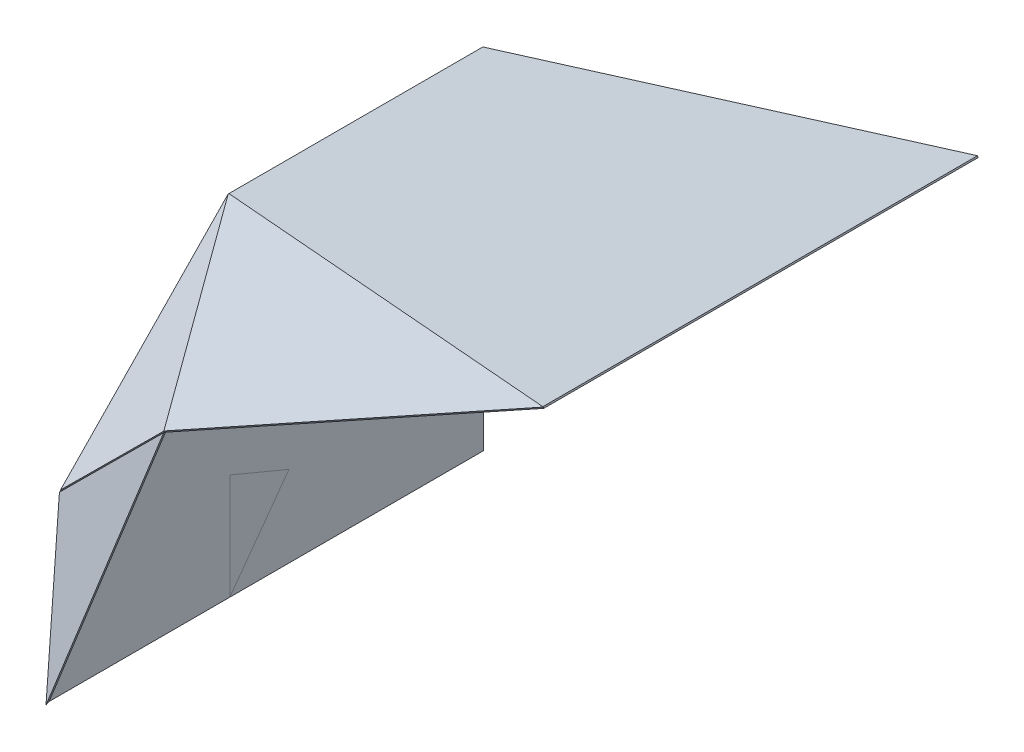
ISO-10303-21;
HEADER;
FILE_DESCRIPTION(('STEP AP214'),'2;1');
FILE_NAME('part.step','',(''),(''),'','','');
FILE_SCHEMA(('AUTOMOTIVE_DESIGN { 1 0 10303 214 1 1 1 1 }'));
ENDSEC;
DATA;
#1=APPLICATION_CONTEXT('core data for automotive mechanical design processes');
#2=APPLICATION_PROTOCOL_DEFINITION('international standard','automotive_design',2000,#1);
#3=PRODUCT_CONTEXT('',#1,'mechanical');
#4=PRODUCT('Part','Part','',(#3));
#5=PRODUCT_RELATED_PRODUCT_CATEGORY('part','',(#4));
#6=PRODUCT_DEFINITION_FORMATION('','',#4);
#7=PRODUCT_DEFINITION_CONTEXT('part definition',#1,'design');
#8=PRODUCT_DEFINITION('design','',#6,#7);
#9=PRODUCT_DEFINITION_SHAPE('','',#8);
#10=(LENGTH_UNIT() NAMED_UNIT(*) SI_UNIT(.MILLI.,.METRE.));
#11=(NAMED_UNIT(*) PLANE_ANGLE_UNIT() SI_UNIT($,.RADIAN.));
#12=(NAMED_UNIT(*) SI_UNIT($,.STERADIAN.) SOLID_ANGLE_UNIT());
#13=UNCERTAINTY_MEASURE_WITH_UNIT(LENGTH_MEASURE(1.E-05),#10,'distance_accuracy_value','');
#14=(GEOMETRIC_REPRESENTATION_CONTEXT(3) GLOBAL_UNCERTAINTY_ASSIGNED_CONTEXT((#13)) GLOBAL_UNIT_ASSIGNED_CONTEXT((#10,
#11,#12)) REPRESENTATION_CONTEXT('',''));
#15=CARTESIAN_POINT('',(0.,0.,0.));
#16=DIRECTION('',(0.,0.,1.));
#17=DIRECTION('',(1.,0.,0.));
#18=AXIS2_PLACEMENT_3D('',#15,#16,#17);
#19=CARTESIAN_POINT('',(8.49999999999999,31.6270900957754,418.859122873948));
#20=DIRECTION('',(-0.638265635687677,-0.0579620545779906,-0.767631017175116));
#21=DIRECTION('',(0.037057489148092,-0.998318786875764,0.0445683998920873));
#22=AXIS2_PLACEMENT_3D('',#19,#20,#21);
#23=PLANE('',#22);
#24=DIRECTION('',(0.611653579416318,0.567298146521138,-0.551409749406815));
#25=VECTOR('',#24,1.);
#26=CARTESIAN_POINT('',(8.49999999999999,168.608775868533,408.515950478226));
#27=LINE('',#26,#25);
#28=CARTESIAN_POINT('',(8.49999999999999,168.608775868533,408.515950478226));
#29=VERTEX_POINT('',#28);
#30=CARTESIAN_POINT('',(9.99999999999999,170.,407.16369055211));
#31=VERTEX_POINT('',#30);
#32=EDGE_CURVE('E13',#29,#31,#27,.T.);
#33=ORIENTED_EDGE('',*,*,#32,.F.);
#34=DIRECTION('',(0.,-0.997161425585,0.0752933684018133));
#35=VECTOR('',#34,1.);
#36=CARTESIAN_POINT('',(8.49999999999999,31.6270900957754,418.859122873948));
#37=LINE('',#36,#35);
#38=CARTESIAN_POINT('',(8.49999999999997,168.89641489962,408.494231515801));
#39=VERTEX_POINT('',#38);
#40=EDGE_CURVE('E148',#39,#29,#37,.T.);
#41=ORIENTED_EDGE('',*,*,#40,.F.);
#42=DIRECTION('',(0.655388158843417,0.482184404709643,-0.581347194972715));
#43=VECTOR('',#42,1.);
#44=CARTESIAN_POINT('',(8.49999999999997,168.89641489962,408.494231515801));
#45=LINE('',#44,#43);
#46=EDGE_CURVE('E82',#39,#31,#45,.T.);
#47=ORIENTED_EDGE('',*,*,#46,.T.);
#48=EDGE_LOOP('',(#33,#41,#47));
#49=FACE_BOUND('',#48,.T.);
#50=ADVANCED_FACE('F72',(#49),#23,.T.);
#51=CARTESIAN_POINT('',(66.3030214988495,225.953893117886,413.581845276055));
#52=DIRECTION('',(-0.682529199996483,0.707716651063141,-0.182458304716812));
#53=DIRECTION('',(-0.706995242186479,-0.702611248260718,-0.0805925638207273));
#54=AXIS2_PLACEMENT_3D('',#51,#52,#53);
#55=PLANE('',#54);
#56=ORIENTED_EDGE('',*,*,#46,.F.);
#57=DIRECTION('',(-0.706995242186479,-0.702611248260718,-0.0805925638207273));
#58=VECTOR('',#57,1.);
#59=CARTESIAN_POINT('',(66.0251705639488,226.064878680719,415.051702773508));
#60=LINE('',#59,#58);
#61=CARTESIAN_POINT('',(122.328192062798,282.018771798606,421.469857497453));
#62=VERTEX_POINT('',#61);
#63=EDGE_CURVE('E153',#62,#39,#60,.T.);
#64=ORIENTED_EDGE('',*,*,#63,.F.);
#65=DIRECTION('',(0.185233956600411,-0.07399037522197,-0.979904998301707));
#66=VECTOR('',#65,1.);
#67=CARTESIAN_POINT('',(122.606042997699,281.907786235773,420.));
#68=LINE('',#67,#66);
#69=CARTESIAN_POINT('',(122.606042997699,281.907786235773,420.));
#70=VERTEX_POINT('',#69);
#71=EDGE_CURVE('E135',#62,#70,#68,.T.);
#72=ORIENTED_EDGE('',*,*,#71,.T.);
#73=DIRECTION('',(-0.706995242186479,-0.702611248260718,-0.0805925638207273));
#74=VECTOR('',#73,1.);
#75=CARTESIAN_POINT('',(66.3030214988495,225.953893117886,413.581845276055));
#76=LINE('',#75,#74);
#77=EDGE_CURVE('E163',#70,#31,#76,.T.);
#78=ORIENTED_EDGE('',*,*,#77,.T.);
#79=EDGE_LOOP('',(#56,#64,#72,#78));
#80=FACE_BOUND('',#79,.T.);
#81=ADVANCED_FACE('F191',(#80),#55,.T.);
#82=CARTESIAN_POINT('',(66.3030214988494,140.953893117886,420.));
#83=DIRECTION('',(0.909993681143599,-0.363490448258812,0.19946476957932));
#84=DIRECTION('',(0.370944580228475,0.928655005047149,0.));
#85=AXIS2_PLACEMENT_3D('',#82,#83,#84);
#86=PLANE('',#85);
#87=ORIENTED_EDGE('',*,*,#71,.F.);
#88=DIRECTION('',(0.370944580228475,0.928655005047149,0.));
#89=VECTOR('',#88,1.);
#90=CARTESIAN_POINT('',(66.0251705639488,141.064878680719,421.469857497453));
#91=LINE('',#90,#89);
#92=CARTESIAN_POINT('',(8.49999999999993,-2.94864896672217,421.469857497453));
#93=VERTEX_POINT('',#92);
#94=EDGE_CURVE('E142',#93,#62,#91,.T.);
#95=ORIENTED_EDGE('',*,*,#94,.F.);
#96=DIRECTION('',(0.414354968712808,0.814524900234045,-0.406028504912805));
#97=VECTOR('',#96,1.);
#98=CARTESIAN_POINT('',(8.49999999999993,-2.94864896672217,421.469857497453));
#99=LINE('',#98,#97);
#100=CARTESIAN_POINT('',(9.99999999999999,-2.4980018054066E-13,420.));
#101=VERTEX_POINT('',#100);
#102=EDGE_CURVE('E126',#93,#101,#99,.T.);
#103=ORIENTED_EDGE('',*,*,#102,.T.);
#104=DIRECTION('',(0.370944580228475,0.928655005047149,0.));
#105=VECTOR('',#104,1.);
#106=CARTESIAN_POINT('',(66.3030214988494,140.953893117886,420.));
#107=LINE('',#106,#105);
#108=EDGE_CURVE('E188',#101,#70,#107,.T.);
#109=ORIENTED_EDGE('',*,*,#108,.T.);
#110=EDGE_LOOP('',(#87,#95,#103,#109));
#111=FACE_BOUND('',#110,.T.);
#112=ADVANCED_FACE('F151',(#111),#86,.T.);
#113=CARTESIAN_POINT('',(8.49999999999999,31.6270900957754,418.859122873948));
#114=DIRECTION('',(-0.638265635687654,-0.057962054577992,-0.767631017175135));
#115=DIRECTION('',(0.0370574891480916,-0.998318786875764,0.0445683998920895));
#116=AXIS2_PLACEMENT_3D('',#113,#114,#115);
#117=PLANE('',#116);
#118=ORIENTED_EDGE('',*,*,#102,.F.);
#119=DIRECTION('',(0.,-0.997161425585,0.0752933684018133));
#120=VECTOR('',#119,1.);
#121=CARTESIAN_POINT('',(8.49999999999999,31.6270900957754,418.859122873948));
#122=LINE('',#121,#120);
#123=CARTESIAN_POINT('',(8.49999999999999,0.,421.247211788099));
#124=VERTEX_POINT('',#123);
#125=EDGE_CURVE('E129',#124,#93,#122,.T.);
#126=ORIENTED_EDGE('',*,*,#125,.F.);
#127=DIRECTION('',(0.768923741861493,-1.22716046094362E-13,-0.639340503332708));
#128=VECTOR('',#127,1.);
#129=CARTESIAN_POINT('',(8.49999999999999,0.,421.247211788099));
#130=LINE('',#129,#128);
#131=EDGE_CURVE('E130',#124,#101,#130,.T.);
#132=ORIENTED_EDGE('',*,*,#131,.T.);
#133=EDGE_LOOP('',(#118,#126,#132));
#134=FACE_BOUND('',#133,.T.);
#135=ADVANCED_FACE('F128',(#134),#117,.T.);
#136=CARTESIAN_POINT('',(9.99999999999999,0.,0.));
#137=DIRECTION('',(0.,1.,0.));
#138=DIRECTION('',(0.,0.,1.));
#139=AXIS2_PLACEMENT_3D('',#136,#137,#138);
#140=PLANE('',#139);
#141=ORIENTED_EDGE('',*,*,#131,.F.);
#142=DIRECTION('',(0.,0.,-1.));
#143=VECTOR('',#142,1.);
#144=CARTESIAN_POINT('',(8.49999999999999,0.,0.));
#145=LINE('',#144,#143);
#146=CARTESIAN_POINT('',(8.49999999999999,0.,0.));
#147=VERTEX_POINT('',#146);
#148=EDGE_CURVE('E159',#147,#124,#145,.F.);
#149=ORIENTED_EDGE('',*,*,#148,.F.);
#150=DIRECTION('',(1.,0.,0.));
#151=VECTOR('',#150,1.);
#152=CARTESIAN_POINT('',(9.99999999999999,0.,0.));
#153=LINE('',#152,#151);
#154=CARTESIAN_POINT('',(9.99999999999999,0.,0.));
#155=VERTEX_POINT('',#154);
#156=EDGE_CURVE('E165',#147,#155,#153,.T.);
#157=ORIENTED_EDGE('',*,*,#156,.T.);
#158=DIRECTION('',(0.,0.,1.));
#159=VECTOR('',#158,1.);
#160=CARTESIAN_POINT('',(9.99999999999999,0.,0.));
#161=LINE('',#160,#159);
#162=EDGE_CURVE('E197',#155,#101,#161,.T.);
#163=ORIENTED_EDGE('',*,*,#162,.T.);
#164=EDGE_LOOP('',(#141,#149,#157,#163));
#165=FACE_BOUND('',#164,.T.);
#166=ADVANCED_FACE('F212',(#165),#140,.F.);
#167=CARTESIAN_POINT('',(9.99999999999999,0.,0.));
#168=DIRECTION('',(0.,0.,-1.));
#169=DIRECTION('',(0.,1.,0.));
#170=AXIS2_PLACEMENT_3D('',#167,#168,#169);
#171=PLANE('',#170);
#172=ORIENTED_EDGE('',*,*,#156,.F.);
#173=DIRECTION('',(0.,1.,0.));
#174=VECTOR('',#173,1.);
#175=CARTESIAN_POINT('',(8.49999999999999,0.,0.));
#176=LINE('',#175,#174);
#177=CARTESIAN_POINT('',(8.49999999999999,336.667890503002,0.));
#178=VERTEX_POINT('',#177);
#179=EDGE_CURVE('E149',#147,#178,#176,.T.);
#180=ORIENTED_EDGE('',*,*,#179,.T.);
#181=DIRECTION('',(1.,0.,0.));
#182=VECTOR('',#181,1.);
#183=CARTESIAN_POINT('',(9.99999999999999,336.667890503002,0.));
#184=LINE('',#183,#182);
#185=CARTESIAN_POINT('',(9.99999999999999,336.667890503002,0.));
#186=VERTEX_POINT('',#185);
#187=EDGE_CURVE('E90',#178,#186,#184,.T.);
#188=ORIENTED_EDGE('',*,*,#187,.T.);
#189=DIRECTION('',(0.,1.,0.));
#190=VECTOR('',#189,1.);
#191=CARTESIAN_POINT('',(9.99999999999999,0.,0.));
#192=LINE('',#191,#190);
#193=EDGE_CURVE('E213',#155,#186,#192,.T.);
#194=ORIENTED_EDGE('',*,*,#193,.F.);
#195=EDGE_LOOP('',(#172,#180,#188,#194));
#196=FACE_BOUND('',#195,.T.);
#197=ADVANCED_FACE('F224',(#196),#171,.T.);
#198=CARTESIAN_POINT('',(9.99999999999999,336.667890503002,0.));
#199=DIRECTION('',(0.,1.,0.));
#200=DIRECTION('',(0.,0.,1.));
#201=AXIS2_PLACEMENT_3D('',#198,#199,#200);
#202=PLANE('',#201);
#203=ORIENTED_EDGE('',*,*,#187,.F.);
#204=DIRECTION('',(0.,0.,-1.));
#205=VECTOR('',#204,1.);
#206=CARTESIAN_POINT('',(8.49999999999999,336.667890503002,0.));
#207=LINE('',#206,#205);
#208=CARTESIAN_POINT('',(8.49999999999999,336.667890503002,245.16369055211));
#209=VERTEX_POINT('',#208);
#210=EDGE_CURVE('E203',#178,#209,#207,.F.);
#211=ORIENTED_EDGE('',*,*,#210,.T.);
#212=DIRECTION('',(1.,0.,0.));
#213=VECTOR('',#212,1.);
#214=CARTESIAN_POINT('',(9.99999999999999,336.667890503002,245.16369055211));
#215=LINE('',#214,#213);
#216=CARTESIAN_POINT('',(9.99999999999999,336.667890503002,245.16369055211));
#217=VERTEX_POINT('',#216);
#218=EDGE_CURVE('E76',#209,#217,#215,.T.);
#219=ORIENTED_EDGE('',*,*,#218,.T.);
#220=DIRECTION('',(0.,0.,1.));
#221=VECTOR('',#220,1.);
#222=CARTESIAN_POINT('',(9.99999999999999,336.667890503002,0.));
#223=LINE('',#222,#221);
#224=EDGE_CURVE('E186',#186,#217,#223,.T.);
#225=ORIENTED_EDGE('',*,*,#224,.F.);
#226=EDGE_LOOP('',(#203,#211,#219,#225));
#227=FACE_BOUND('',#226,.T.);
#228=ADVANCED_FACE('F217',(#227),#202,.T.);
#229=CARTESIAN_POINT('',(9.99999999999999,170.,407.16369055211));
#230=DIRECTION('',(0.,0.696993838192432,0.717077115463729));
#231=DIRECTION('',(0.,-0.717077115463729,0.696993838192432));
#232=AXIS2_PLACEMENT_3D('',#229,#230,#231);
#233=PLANE('',#232);
#234=DIRECTION('',(0.,-0.717077115463729,0.696993838192432));
#235=VECTOR('',#234,1.);
#236=CARTESIAN_POINT('',(8.49999999999999,170.,407.16369055211));
#237=LINE('',#236,#235);
#238=EDGE_CURVE('E152',#209,#29,#237,.T.);
#239=ORIENTED_EDGE('',*,*,#238,.T.);
#240=ORIENTED_EDGE('',*,*,#32,.T.);
#241=DIRECTION('',(0.,-0.717077115463729,0.696993838192432));
#242=VECTOR('',#241,1.);
#243=CARTESIAN_POINT('',(9.99999999999999,170.,407.16369055211));
#244=LINE('',#243,#242);
#245=EDGE_CURVE('E180',#217,#31,#244,.T.);
#246=ORIENTED_EDGE('',*,*,#245,.F.);
#247=ORIENTED_EDGE('',*,*,#218,.F.);
#248=EDGE_LOOP('',(#239,#240,#246,#247));
#249=FACE_BOUND('',#248,.T.);
#250=ADVANCED_FACE('F74',(#249),#233,.T.);
#251=CARTESIAN_POINT('',(9.99999999999999,0.,0.));
#252=DIRECTION('',(1.,0.,0.));
#253=DIRECTION('',(0.,0.,-1.));
#254=AXIS2_PLACEMENT_3D('',#251,#252,#253);
#255=PLANE('',#254);
#256=ORIENTED_EDGE('',*,*,#224,.T.);
#257=ORIENTED_EDGE('',*,*,#245,.T.);
#258=DIRECTION('',(0.,-0.997161425585,0.0752933684018133));
#259=VECTOR('',#258,1.);
#260=CARTESIAN_POINT('',(9.99999999999999,-2.4980018054066E-13,420.));
#261=LINE('',#260,#259);
#262=EDGE_CURVE('E184',#31,#101,#261,.T.);
#263=ORIENTED_EDGE('',*,*,#262,.T.);
#264=ORIENTED_EDGE('',*,*,#162,.F.);
#265=ORIENTED_EDGE('',*,*,#193,.T.);
#266=EDGE_LOOP('',(#256,#257,#263,#264,#265));
#267=FACE_BOUND('',#266,.T.);
#268=ADVANCED_FACE('F181',(#267),#255,.T.);
#269=CARTESIAN_POINT('',(9.99999999999999,170.,407.16369055211));
#270=DIRECTION('',(-0.185233956600411,0.07399037522197,0.979904998301707));
#271=DIRECTION('',(0.,-0.997161425585,0.0752933684018133));
#272=AXIS2_PLACEMENT_3D('',#269,#270,#271);
#273=PLANE('',#272);
#274=ORIENTED_EDGE('',*,*,#262,.F.);
#275=ORIENTED_EDGE('',*,*,#77,.F.);
#276=ORIENTED_EDGE('',*,*,#108,.F.);
#277=EDGE_LOOP('',(#274,#275,#276));
#278=FACE_BOUND('',#277,.T.);
#279=ADVANCED_FACE('F194',(#278),#273,.F.);
#280=CARTESIAN_POINT('',(8.49999999999999,0.,0.));
#281=DIRECTION('',(1.,0.,0.));
#282=DIRECTION('',(0.,0.,-1.));
#283=AXIS2_PLACEMENT_3D('',#280,#281,#282);
#284=PLANE('',#283);
#285=ORIENTED_EDGE('',*,*,#210,.F.);
#286=ORIENTED_EDGE('',*,*,#179,.F.);
#287=ORIENTED_EDGE('',*,*,#148,.T.);
#288=DIRECTION('',(0.,-0.997161425585,0.0752933684018133));
#289=VECTOR('',#288,1.);
#290=CARTESIAN_POINT('',(8.49999999999999,31.6270900957754,418.859122873948));
#291=LINE('',#290,#289);
#292=EDGE_CURVE('E146',#29,#124,#291,.T.);
#293=ORIENTED_EDGE('',*,*,#292,.F.);
#294=ORIENTED_EDGE('',*,*,#238,.F.);
#295=EDGE_LOOP('',(#285,#286,#287,#293,#294));
#296=FACE_BOUND('',#295,.T.);
#297=ADVANCED_FACE('F209',(#296),#284,.F.);
#298=CARTESIAN_POINT('',(9.72214906509938,170.110985562832,408.633548049563));
#299=DIRECTION('',(-0.185233956600411,0.07399037522197,0.979904998301707));
#300=DIRECTION('',(0.,-0.997161425585,0.0752933684018133));
#301=AXIS2_PLACEMENT_3D('',#298,#299,#300);
#302=PLANE('',#301);
#303=ORIENTED_EDGE('',*,*,#292,.T.);
#304=ORIENTED_EDGE('',*,*,#125,.T.);
#305=ORIENTED_EDGE('',*,*,#94,.T.);
#306=ORIENTED_EDGE('',*,*,#63,.T.);
#307=ORIENTED_EDGE('',*,*,#40,.T.);
#308=EDGE_LOOP('',(#303,#304,#305,#306,#307));
#309=FACE_BOUND('',#308,.T.);
#310=ADVANCED_FACE('F140',(#309),#302,.T.);
#311=CLOSED_SHELL('',(#50,#81,#112,#135,#166,#197,#228,#250,#268,#279,#297,#310));
#312=MANIFOLD_SOLID_BREP('B2',#311);
#313=CARTESIAN_POINT('',(488.467163754665,484.7993948045,420.));
#314=DIRECTION('',(0.245280546018566,-0.442298309423847,0.862675871475284));
#315=DIRECTION('',(-0.874526973380525,-0.48497687865495,0.));
#316=AXIS2_PLACEMENT_3D('',#313,#314,#315);
#317=PLANE('',#316);
#318=DIRECTION('',(-0.196218257252625,-0.894091309795686,-0.402615356473865));
#319=VECTOR('',#318,1.);
#320=CARTESIAN_POINT('',(488.836891811084,486.484103693776,420.758635793212));
#321=LINE('',#320,#319);
#322=CARTESIAN_POINT('',(488.836891811084,486.484103693776,420.758635793212));
#323=VERTEX_POINT('',#322);
#324=CARTESIAN_POINT('',(488.467163754665,484.7993948045,420.));
#325=VERTEX_POINT('',#324);
#326=EDGE_CURVE('E70',#323,#325,#321,.T.);
#327=ORIENTED_EDGE('',*,*,#326,.F.);
#328=DIRECTION('',(-0.874526973380525,-0.48497687865495,0.));
#329=VECTOR('',#328,1.);
#330=CARTESIAN_POINT('',(487.839596977507,485.931044782834,420.758635793212));
#331=LINE('',#330,#329);
#332=CARTESIAN_POINT('',(121.776230955397,282.927279264811,420.758635793212));
#333=VERTEX_POINT('',#332);
#334=EDGE_CURVE('E414',#323,#333,#331,.T.);
#335=ORIENTED_EDGE('',*,*,#334,.T.);
#336=DIRECTION('',(0.546748110233947,-0.671725473490127,-0.499851370129233));
#337=VECTOR('',#336,1.);
#338=CARTESIAN_POINT('',(121.776230955397,282.927279264811,420.758635793212));
#339=LINE('',#338,#337);
#340=CARTESIAN_POINT('',(122.606042997699,281.907786235773,420.));
#341=VERTEX_POINT('',#340);
#342=EDGE_CURVE('E335',#333,#341,#339,.T.);
#343=ORIENTED_EDGE('',*,*,#342,.T.);
#344=DIRECTION('',(-0.874526973380525,-0.48497687865495,0.));
#345=VECTOR('',#344,1.);
#346=CARTESIAN_POINT('',(488.467163754665,484.7993948045,420.));
#347=LINE('',#346,#345);
#348=EDGE_CURVE('E442',#325,#341,#347,.T.);
#349=ORIENTED_EDGE('',*,*,#348,.F.);
#350=EDGE_LOOP('',(#327,#335,#343,#349));
#351=FACE_BOUND('',#350,.T.);
#352=ADVANCED_FACE('F325',(#351),#317,.T.);
#353=CARTESIAN_POINT('',(-53.0099998921732,367.925490469911,149.379065654861));
#354=DIRECTION('',(0.674272379234324,0.707162305472514,-0.212786823653354));
#355=DIRECTION('',(-0.146839091596808,-0.15400166719717,-0.977098647875186));
#356=AXIS2_PLACEMENT_3D('',#353,#354,#355);
#357=PLANE('',#356);
#358=ORIENTED_EDGE('',*,*,#342,.F.);
#359=DIRECTION('',(-0.523627135809791,0.254638878969231,-0.813002868359595));
#360=VECTOR('',#359,1.);
#361=CARTESIAN_POINT('',(-53.0099998921732,367.925490469911,149.379065654861));
#362=LINE('',#361,#360);
#363=CARTESIAN_POINT('',(121.847054197578,282.892838057011,420.868598579902));
#364=VERTEX_POINT('',#363);
#365=EDGE_CURVE('E416',#364,#333,#362,.T.);
#366=ORIENTED_EDGE('',*,*,#365,.F.);
#367=DIRECTION('',(0.500369444949905,-0.649403302079626,-0.572630570096115));
#368=VECTOR('',#367,1.);
#369=CARTESIAN_POINT('',(121.847054197578,282.892838057011,420.868598579902));
#370=LINE('',#369,#368);
#371=EDGE_CURVE('E437',#364,#341,#370,.T.);
#372=ORIENTED_EDGE('',*,*,#371,.T.);
#373=EDGE_LOOP('',(#358,#366,#372));
#374=FACE_BOUND('',#373,.T.);
#375=ADVANCED_FACE('F444',(#374),#357,.T.);
#376=CARTESIAN_POINT('',(66.3030214988494,225.953893117886,413.581845276055));
#377=DIRECTION('',(0.353932853794839,-0.45017594444884,0.819800679460706));
#378=DIRECTION('',(0.706995242186479,0.702611248260718,0.0805925638207276));
#379=AXIS2_PLACEMENT_3D('',#376,#377,#378);
#380=PLANE('',#379);
#381=ORIENTED_EDGE('',*,*,#371,.F.);
#382=DIRECTION('',(0.706995242186479,0.702611248260718,0.0805925638207276));
#383=VECTOR('',#382,1.);
#384=CARTESIAN_POINT('',(65.3845984804678,226.780499353605,414.432269458671));
#385=LINE('',#384,#383);
#386=CARTESIAN_POINT('',(9.08157698161835,170.826606235718,408.014114734726));
#387=VERTEX_POINT('',#386);
#388=EDGE_CURVE('E476',#387,#364,#385,.T.);
#389=ORIENTED_EDGE('',*,*,#388,.F.);
#390=DIRECTION('',(0.612282012254421,-0.551070823812249,-0.566949455077405));
#391=VECTOR('',#390,1.);
#392=CARTESIAN_POINT('',(9.99999999999998,170.,407.16369055211));
#393=LINE('',#392,#391);
#394=CARTESIAN_POINT('',(9.99999999999998,170.,407.16369055211));
#395=VERTEX_POINT('',#394);
#396=EDGE_CURVE('E435',#387,#395,#393,.T.);
#397=ORIENTED_EDGE('',*,*,#396,.T.);
#398=DIRECTION('',(0.706995242186479,0.702611248260718,0.0805925638207276));
#399=VECTOR('',#398,1.);
#400=CARTESIAN_POINT('',(66.3030214988494,225.953893117886,413.581845276055));
#401=LINE('',#400,#399);
#402=EDGE_CURVE('E415',#395,#341,#401,.T.);
#403=ORIENTED_EDGE('',*,*,#402,.T.);
#404=EDGE_LOOP('',(#381,#389,#397,#403));
#405=FACE_BOUND('',#404,.T.);
#406=ADVANCED_FACE('F457',(#405),#380,.T.);
#407=CARTESIAN_POINT('',(9.99999999999998,253.333945251501,326.16369055211));
#408=DIRECTION('',(-0.790639448465403,-0.426756789777395,-0.439053419197727));
#409=DIRECTION('',(0.,-0.717077115463728,0.696993838192432));
#410=AXIS2_PLACEMENT_3D('',#407,#408,#409);
#411=PLANE('',#410);
#412=ORIENTED_EDGE('',*,*,#396,.F.);
#413=DIRECTION('',(0.,-0.717077115463728,0.696993838192432));
#414=VECTOR('',#413,1.);
#415=CARTESIAN_POINT('',(9.08157698161838,337.494496738721,246.014114734726));
#416=LINE('',#415,#414);
#417=CARTESIAN_POINT('',(9.08157698161838,337.730474880961,245.78474566473));
#418=VERTEX_POINT('',#417);
#419=EDGE_CURVE('E473',#418,#387,#416,.T.);
#420=ORIENTED_EDGE('',*,*,#419,.F.);
#421=DIRECTION('',(0.598058429651742,-0.6919333811712,-0.404418484670869));
#422=VECTOR('',#421,1.);
#423=CARTESIAN_POINT('',(9.08157698161838,337.730474880961,245.78474566473));
#424=LINE('',#423,#422);
#425=CARTESIAN_POINT('',(9.99999999999998,336.667890503002,245.16369055211));
#426=VERTEX_POINT('',#425);
#427=EDGE_CURVE('E432',#418,#426,#424,.T.);
#428=ORIENTED_EDGE('',*,*,#427,.T.);
#429=DIRECTION('',(0.,-0.717077115463728,0.696993838192432));
#430=VECTOR('',#429,1.);
#431=CARTESIAN_POINT('',(9.99999999999998,253.333945251501,326.16369055211));
#432=LINE('',#431,#430);
#433=EDGE_CURVE('E419',#426,#395,#432,.T.);
#434=ORIENTED_EDGE('',*,*,#433,.T.);
#435=EDGE_LOOP('',(#412,#420,#428,#434));
#436=FACE_BOUND('',#435,.T.);
#437=ADVANCED_FACE('F482',(#436),#411,.T.);
#438=CARTESIAN_POINT('',(-101.21667099556,251.705076894321,282.865943270009));
#439=DIRECTION('',(0.42237730966333,-0.156728024760813,0.892767458264548));
#440=DIRECTION('',(-0.0670266906568635,-0.987641800580845,-0.141672497278107));
#441=AXIS2_PLACEMENT_3D('',#438,#439,#440);
#442=PLANE('',#441);
#443=ORIENTED_EDGE('',*,*,#427,.F.);
#444=DIRECTION('',(0.762200088609128,0.594466069684252,-0.256244252459244));
#445=VECTOR('',#444,1.);
#446=CARTESIAN_POINT('',(-101.21667099556,251.705076894321,282.865943270009));
#447=LINE('',#446,#445);
#448=CARTESIAN_POINT('',(9.55638005392409,338.100790130835,245.625121492355));
#449=VERTEX_POINT('',#448);
#450=EDGE_CURVE('E422',#418,#449,#447,.T.);
#451=ORIENTED_EDGE('',*,*,#450,.T.);
#452=DIRECTION('',(0.282674116289812,-0.913041984727063,-0.294023261163875));
#453=VECTOR('',#452,1.);
#454=CARTESIAN_POINT('',(9.55638005392409,338.100790130835,245.625121492355));
#455=LINE('',#454,#453);
#456=EDGE_CURVE('E429',#449,#426,#455,.T.);
#457=ORIENTED_EDGE('',*,*,#456,.T.);
#458=EDGE_LOOP('',(#443,#451,#457));
#459=FACE_BOUND('',#458,.T.);
#460=ADVANCED_FACE('F479',(#459),#442,.F.);
#461=CARTESIAN_POINT('',(9.99999999999998,336.667890503002,0.));
#462=DIRECTION('',(0.955266418555253,0.295746630717276,0.));
#463=DIRECTION('',(0.,0.,1.));
#464=AXIS2_PLACEMENT_3D('',#461,#462,#463);
#465=PLANE('',#464);
#466=ORIENTED_EDGE('',*,*,#456,.F.);
#467=DIRECTION('',(0.,0.,1.));
#468=VECTOR('',#467,1.);
#469=CARTESIAN_POINT('',(9.55638005392409,338.100790130835,0.));
#470=LINE('',#469,#468);
#471=CARTESIAN_POINT('',(9.55638005392409,338.100790130835,0.));
#472=VERTEX_POINT('',#471);
#473=EDGE_CURVE('E403',#472,#449,#470,.T.);
#474=ORIENTED_EDGE('',*,*,#473,.F.);
#475=DIRECTION('',(0.295746630717276,-0.955266418555253,0.));
#476=VECTOR('',#475,1.);
#477=CARTESIAN_POINT('',(9.99999999999998,336.667890503002,0.));
#478=LINE('',#477,#476);
#479=CARTESIAN_POINT('',(9.99999999999998,336.667890503002,0.));
#480=VERTEX_POINT('',#479);
#481=EDGE_CURVE('E427',#472,#480,#478,.T.);
#482=ORIENTED_EDGE('',*,*,#481,.T.);
#483=DIRECTION('',(0.,0.,1.));
#484=VECTOR('',#483,1.);
#485=CARTESIAN_POINT('',(9.99999999999998,336.667890503002,0.));
#486=LINE('',#485,#484);
#487=EDGE_CURVE('E610',#480,#426,#486,.T.);
#488=ORIENTED_EDGE('',*,*,#487,.T.);
#489=EDGE_LOOP('',(#466,#474,#482,#488));
#490=FACE_BOUND('',#489,.T.);
#491=ADVANCED_FACE('F504',(#490),#465,.F.);
#492=CARTESIAN_POINT('',(9.99999999999998,336.667890503002,0.));
#493=DIRECTION('',(0.,0.,-1.));
#494=DIRECTION('',(0.955266418555253,0.295746630717276,0.));
#495=AXIS2_PLACEMENT_3D('',#492,#493,#494);
#496=PLANE('',#495);
#497=ORIENTED_EDGE('',*,*,#481,.F.);
#498=DIRECTION('',(0.955266418555253,0.295746630717276,0.));
#499=VECTOR('',#498,1.);
#500=CARTESIAN_POINT('',(9.55638005392409,338.100790130835,0.));
#501=LINE('',#500,#499);
#502=CARTESIAN_POINT('',(488.023543808589,486.232294432333,0.));
#503=VERTEX_POINT('',#502);
#504=EDGE_CURVE('E470',#472,#503,#501,.T.);
#505=ORIENTED_EDGE('',*,*,#504,.T.);
#506=DIRECTION('',(0.295746630717276,-0.955266418555253,0.));
#507=VECTOR('',#506,1.);
#508=CARTESIAN_POINT('',(488.467163754665,484.7993948045,0.));
#509=LINE('',#508,#507);
#510=CARTESIAN_POINT('',(488.467163754665,484.7993948045,0.));
#511=VERTEX_POINT('',#510);
#512=EDGE_CURVE('E343',#503,#511,#509,.T.);
#513=ORIENTED_EDGE('',*,*,#512,.T.);
#514=DIRECTION('',(0.955266418555253,0.295746630717276,0.));
#515=VECTOR('',#514,1.);
#516=CARTESIAN_POINT('',(9.99999999999998,336.667890503002,0.));
#517=LINE('',#516,#515);
#518=EDGE_CURVE('E393',#480,#511,#517,.T.);
#519=ORIENTED_EDGE('',*,*,#518,.F.);
#520=EDGE_LOOP('',(#497,#505,#513,#519));
#521=FACE_BOUND('',#520,.T.);
#522=ADVANCED_FACE('F507',(#521),#496,.T.);
#523=CARTESIAN_POINT('',(488.467163754665,484.7993948045,0.));
#524=DIRECTION('',(0.955266418555253,0.295746630717276,0.));
#525=DIRECTION('',(0.,0.,1.));
#526=AXIS2_PLACEMENT_3D('',#523,#524,#525);
#527=PLANE('',#526);
#528=ORIENTED_EDGE('',*,*,#512,.F.);
#529=DIRECTION('',(0.,0.,1.));
#530=VECTOR('',#529,1.);
#531=CARTESIAN_POINT('',(488.023543808589,486.232294432333,0.));
#532=LINE('',#531,#530);
#533=CARTESIAN_POINT('',(488.023543808589,486.232294432333,420.461430940245));
#534=VERTEX_POINT('',#533);
#535=EDGE_CURVE('E401',#503,#534,#532,.T.);
#536=ORIENTED_EDGE('',*,*,#535,.T.);
#537=DIRECTION('',(0.282674116289968,-0.91304198472708,-0.294023261163673));
#538=VECTOR('',#537,1.);
#539=CARTESIAN_POINT('',(488.023543808589,486.232294432333,420.461430940245));
#540=LINE('',#539,#538);
#541=EDGE_CURVE('E329',#534,#325,#540,.T.);
#542=ORIENTED_EDGE('',*,*,#541,.T.);
#543=DIRECTION('',(0.,0.,1.));
#544=VECTOR('',#543,1.);
#545=CARTESIAN_POINT('',(488.467163754665,484.7993948045,0.));
#546=LINE('',#545,#544);
#547=EDGE_CURVE('E464',#511,#325,#546,.T.);
#548=ORIENTED_EDGE('',*,*,#547,.F.);
#549=EDGE_LOOP('',(#528,#536,#542,#548));
#550=FACE_BOUND('',#549,.T.);
#551=ADVANCED_FACE('F409',(#550),#527,.T.);
#552=CARTESIAN_POINT('',(-156.369348912346,286.730853600146,184.994331560471));
#553=DIRECTION('',(0.219840291928775,0.360032355542445,-0.906668047858327));
#554=DIRECTION('',(-0.975535876349338,0.0811345026514559,-0.204320695072306));
#555=AXIS2_PLACEMENT_3D('',#552,#553,#554);
#556=PLANE('',#555);
#557=DIRECTION('',(-0.901899334658796,-0.279224396765565,-0.329562325506008));
#558=VECTOR('',#557,1.);
#559=CARTESIAN_POINT('',(-156.369348912346,286.730853600146,184.994331560471));
#560=LINE('',#559,#558);
#561=EDGE_CURVE('E389',#323,#534,#560,.T.);
#562=ORIENTED_EDGE('',*,*,#561,.F.);
#563=ORIENTED_EDGE('',*,*,#326,.T.);
#564=ORIENTED_EDGE('',*,*,#541,.F.);
#565=EDGE_LOOP('',(#562,#563,#564));
#566=FACE_BOUND('',#565,.T.);
#567=ADVANCED_FACE('F327',(#566),#556,.T.);
#568=CARTESIAN_POINT('',(9.99999999999998,336.667890503002,0.));
#569=DIRECTION('',(0.295746630717276,-0.955266418555253,0.));
#570=DIRECTION('',(0.955266418555253,0.295746630717276,0.));
#571=AXIS2_PLACEMENT_3D('',#568,#569,#570);
#572=PLANE('',#571);
#573=ORIENTED_EDGE('',*,*,#547,.T.);
#574=DIRECTION('',(-0.901899334658796,-0.279224396765565,-0.329562325506008));
#575=VECTOR('',#574,1.);
#576=CARTESIAN_POINT('',(488.467163754665,484.7993948045,420.));
#577=LINE('',#576,#575);
#578=EDGE_CURVE('E454',#325,#426,#577,.T.);
#579=ORIENTED_EDGE('',*,*,#578,.T.);
#580=ORIENTED_EDGE('',*,*,#487,.F.);
#581=ORIENTED_EDGE('',*,*,#518,.T.);
#582=EDGE_LOOP('',(#573,#579,#580,#581));
#583=FACE_BOUND('',#582,.T.);
#584=ADVANCED_FACE('F514',(#583),#572,.T.);
#585=CARTESIAN_POINT('',(-156.390894347707,282.009434918816,189.053554940857));
#586=DIRECTION('',(0.418377851439022,-0.754433318889687,-0.505757195474626));
#587=DIRECTION('',(0.,0.556833854304177,-0.830623897260821));
#588=AXIS2_PLACEMENT_3D('',#585,#586,#587);
#589=PLANE('',#588);
#590=ORIENTED_EDGE('',*,*,#348,.T.);
#591=DIRECTION('',(-0.523627135809791,0.25463887896923,-0.813002868359594));
#592=VECTOR('',#591,1.);
#593=CARTESIAN_POINT('',(122.606042997699,281.907786235773,420.));
#594=LINE('',#593,#592);
#595=EDGE_CURVE('E452',#341,#426,#594,.T.);
#596=ORIENTED_EDGE('',*,*,#595,.T.);
#597=ORIENTED_EDGE('',*,*,#578,.F.);
#598=EDGE_LOOP('',(#590,#596,#597));
#599=FACE_BOUND('',#598,.T.);
#600=ADVANCED_FACE('F450',(#599),#589,.T.);
#601=CARTESIAN_POINT('',(9.99999999999998,336.667890503002,245.16369055211));
#602=DIRECTION('',(-0.612282012254421,0.551070823812249,0.566949455077405));
#603=DIRECTION('',(0.,-0.717077115463728,0.696993838192432));
#604=AXIS2_PLACEMENT_3D('',#601,#602,#603);
#605=PLANE('',#604);
#606=ORIENTED_EDGE('',*,*,#433,.F.);
#607=ORIENTED_EDGE('',*,*,#595,.F.);
#608=ORIENTED_EDGE('',*,*,#402,.F.);
#609=EDGE_LOOP('',(#606,#607,#608));
#610=FACE_BOUND('',#609,.T.);
#611=ADVANCED_FACE('F461',(#610),#605,.F.);
#612=CARTESIAN_POINT('',(9.55638005392409,338.100790130835,0.));
#613=DIRECTION('',(0.295746630717276,-0.955266418555253,0.));
#614=DIRECTION('',(0.955266418555253,0.295746630717276,0.));
#615=AXIS2_PLACEMENT_3D('',#612,#613,#614);
#616=PLANE('',#615);
#617=ORIENTED_EDGE('',*,*,#535,.F.);
#618=ORIENTED_EDGE('',*,*,#504,.F.);
#619=ORIENTED_EDGE('',*,*,#473,.T.);
#620=DIRECTION('',(-0.901899334658796,-0.279224396765565,-0.329562325506008));
#621=VECTOR('',#620,1.);
#622=CARTESIAN_POINT('',(-156.369348912346,286.730853600146,184.994331560471));
#623=LINE('',#622,#621);
#624=EDGE_CURVE('E398',#534,#449,#623,.T.);
#625=ORIENTED_EDGE('',*,*,#624,.F.);
#626=EDGE_LOOP('',(#617,#618,#619,#625));
#627=FACE_BOUND('',#626,.T.);
#628=ADVANCED_FACE('F399',(#627),#616,.F.);
#629=CARTESIAN_POINT('',(-157.018461124865,283.14108489715,189.812190734069));
#630=DIRECTION('',(0.418377851439022,-0.754433318889687,-0.505757195474626));
#631=DIRECTION('',(0.,0.556833854304177,-0.830623897260821));
#632=AXIS2_PLACEMENT_3D('',#629,#630,#631);
#633=PLANE('',#632);
#634=ORIENTED_EDGE('',*,*,#334,.F.);
#635=ORIENTED_EDGE('',*,*,#561,.T.);
#636=ORIENTED_EDGE('',*,*,#624,.T.);
#637=ORIENTED_EDGE('',*,*,#450,.F.);
#638=DIRECTION('',(-0.523627135809791,0.254638878969231,-0.813002868359595));
#639=VECTOR('',#638,1.);
#640=CARTESIAN_POINT('',(-53.0099998921732,367.925490469911,149.379065654861));
#641=LINE('',#640,#639);
#642=EDGE_CURVE('E407',#333,#418,#641,.T.);
#643=ORIENTED_EDGE('',*,*,#642,.F.);
#644=EDGE_LOOP('',(#634,#635,#636,#637,#643));
#645=FACE_BOUND('',#644,.T.);
#646=ADVANCED_FACE('F412',(#645),#633,.F.);
#647=CARTESIAN_POINT('',(9.08157698161835,337.494496738721,246.014114734726));
#648=DIRECTION('',(-0.612282012254421,0.551070823812249,0.566949455077405));
#649=DIRECTION('',(0.,-0.717077115463728,0.696993838192432));
#650=AXIS2_PLACEMENT_3D('',#647,#648,#649);
#651=PLANE('',#650);
#652=ORIENTED_EDGE('',*,*,#419,.T.);
#653=ORIENTED_EDGE('',*,*,#388,.T.);
#654=ORIENTED_EDGE('',*,*,#365,.T.);
#655=ORIENTED_EDGE('',*,*,#642,.T.);
#656=EDGE_LOOP('',(#652,#653,#654,#655));
#657=FACE_BOUND('',#656,.T.);
#658=ADVANCED_FACE('F484',(#657),#651,.T.);
#659=CLOSED_SHELL('',(#352,#375,#406,#437,#460,#491,#522,#551,#567,#584,#600,#611,#628,#646,#658));
#660=MANIFOLD_SOLID_BREP('B7',#659);
#661=CARTESIAN_POINT('',(9.99999999999999,336.667890503002,0.));
#662=DIRECTION('',(0.295746630717276,-0.955266418555253,0.));
#663=DIRECTION('',(0.955266418555253,0.295746630717276,0.));
#664=AXIS2_PLACEMENT_3D('',#661,#662,#663);
#665=PLANE('',#664);
#666=DIRECTION('',(0.,0.,1.));
#667=VECTOR('',#666,1.);
#668=CARTESIAN_POINT('',(488.467163754665,484.7993948045,0.));
#669=LINE('',#668,#667);
#670=CARTESIAN_POINT('',(488.467163754665,484.7993948045,0.));
#671=VERTEX_POINT('',#670);
#672=CARTESIAN_POINT('',(488.467163754665,484.7993948045,245.16369055211));
#673=VERTEX_POINT('',#672);
#674=EDGE_CURVE('E636',#671,#673,#669,.T.);
#675=ORIENTED_EDGE('',*,*,#674,.T.);
#676=DIRECTION('',(-0.955266418555253,-0.295746630717276,0.));
#677=VECTOR('',#676,1.);
#678=CARTESIAN_POINT('',(10.,336.667890503002,245.16369055211));
#679=LINE('',#678,#677);
#680=CARTESIAN_POINT('',(9.99999999999999,336.667890503002,245.16369055211));
#681=VERTEX_POINT('',#680);
#682=EDGE_CURVE('E620',#673,#681,#679,.T.);
#683=ORIENTED_EDGE('',*,*,#682,.T.);
#684=DIRECTION('',(0.,0.,1.));
#685=VECTOR('',#684,1.);
#686=CARTESIAN_POINT('',(9.99999999999999,336.667890503002,0.));
#687=LINE('',#686,#685);
#688=CARTESIAN_POINT('',(9.99999999999999,336.667890503002,0.));
#689=VERTEX_POINT('',#688);
#690=EDGE_CURVE('E663',#689,#681,#687,.T.);
#691=ORIENTED_EDGE('',*,*,#690,.F.);
#692=DIRECTION('',(0.955266418555253,0.295746630717276,0.));
#693=VECTOR('',#692,1.);
#694=CARTESIAN_POINT('',(9.99999999999999,336.667890503002,0.));
#695=LINE('',#694,#693);
#696=EDGE_CURVE('E661',#689,#671,#695,.T.);
#697=ORIENTED_EDGE('',*,*,#696,.T.);
#698=EDGE_LOOP('',(#675,#683,#691,#697));
#699=FACE_BOUND('',#698,.T.);
#700=ADVANCED_FACE('F617',(#699),#665,.T.);
#701=CARTESIAN_POINT('',(9.99999999999999,0.,0.));
#702=DIRECTION('',(1.,0.,0.));
#703=DIRECTION('',(0.,0.,-1.));
#704=AXIS2_PLACEMENT_3D('',#701,#702,#703);
#705=PLANE('',#704);
#706=ORIENTED_EDGE('',*,*,#690,.T.);
#707=DIRECTION('',(0.,-1.,0.));
#708=VECTOR('',#707,1.);
#709=CARTESIAN_POINT('',(9.99999999999999,0.,245.16369055211));
#710=LINE('',#709,#708);
#711=CARTESIAN_POINT('',(9.99999999999999,0.,245.16369055211));
#712=VERTEX_POINT('',#711);
#713=EDGE_CURVE('E323',#681,#712,#710,.T.);
#714=ORIENTED_EDGE('',*,*,#713,.T.);
#715=DIRECTION('',(0.,0.,1.));
#716=VECTOR('',#715,1.);
#717=CARTESIAN_POINT('',(9.99999999999999,0.,0.));
#718=LINE('',#717,#716);
#719=CARTESIAN_POINT('',(9.99999999999999,0.,0.));
#720=VERTEX_POINT('',#719);
#721=EDGE_CURVE('E649',#720,#712,#718,.T.);
#722=ORIENTED_EDGE('',*,*,#721,.F.);
#723=DIRECTION('',(0.,1.,0.));
#724=VECTOR('',#723,1.);
#725=CARTESIAN_POINT('',(9.99999999999999,0.,0.));
#726=LINE('',#725,#724);
#727=EDGE_CURVE('E652',#720,#689,#726,.T.);
#728=ORIENTED_EDGE('',*,*,#727,.T.);
#729=EDGE_LOOP('',(#706,#714,#722,#728));
#730=FACE_BOUND('',#729,.T.);
#731=ADVANCED_FACE('F618',(#730),#705,.T.);
#732=OPEN_SHELL('',(#700,#731));
#733=SHELL_BASED_SURFACE_MODEL('B64',(#732));
#734=ADVANCED_BREP_SHAPE_REPRESENTATION('',(#18,#312,#660),#14);
#735=MANIFOLD_SURFACE_SHAPE_REPRESENTATION('',(#18,#733),#14);
#736=SHAPE_REPRESENTATION('',(#18),#14);
#737=SHAPE_DEFINITION_REPRESENTATION(#9,#736);
#738=SHAPE_REPRESENTATION_RELATIONSHIP('','',#736,#734);
#739=SHAPE_REPRESENTATION_RELATIONSHIP('','',#736,#735);
ENDSEC;
END-ISO-10303-21;
